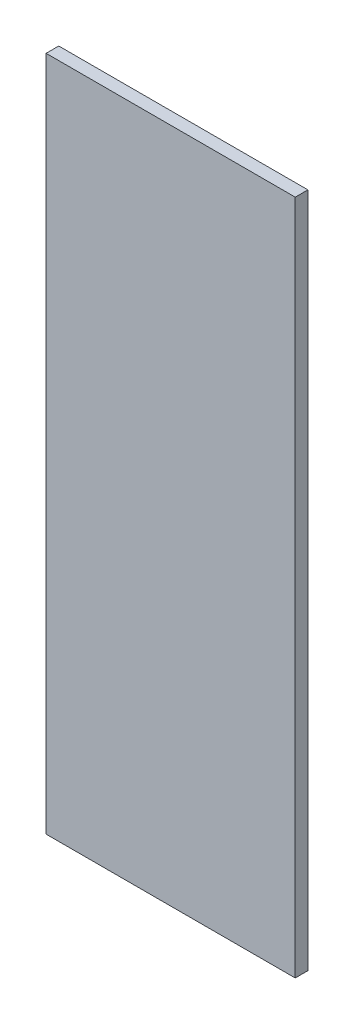
ISO-10303-21;
HEADER;
FILE_DESCRIPTION(('STEP AP214'),'2;1');
FILE_NAME('part.step','',(''),(''),'','','');
FILE_SCHEMA(('AUTOMOTIVE_DESIGN { 1 0 10303 214 1 1 1 1 }'));
ENDSEC;
DATA;
#1=APPLICATION_CONTEXT('core data for automotive mechanical design processes');
#2=APPLICATION_PROTOCOL_DEFINITION('international standard','automotive_design',2000,#1);
#3=PRODUCT_CONTEXT('',#1,'mechanical');
#4=PRODUCT('Part','Part','',(#3));
#5=PRODUCT_RELATED_PRODUCT_CATEGORY('part','',(#4));
#6=PRODUCT_DEFINITION_FORMATION('','',#4);
#7=PRODUCT_DEFINITION_CONTEXT('part definition',#1,'design');
#8=PRODUCT_DEFINITION('design','',#6,#7);
#9=PRODUCT_DEFINITION_SHAPE('','',#8);
#10=(LENGTH_UNIT() NAMED_UNIT(*) SI_UNIT(.MILLI.,.METRE.));
#11=(NAMED_UNIT(*) PLANE_ANGLE_UNIT() SI_UNIT($,.RADIAN.));
#12=(NAMED_UNIT(*) SI_UNIT($,.STERADIAN.) SOLID_ANGLE_UNIT());
#13=UNCERTAINTY_MEASURE_WITH_UNIT(LENGTH_MEASURE(1.E-05),#10,'distance_accuracy_value','');
#14=(GEOMETRIC_REPRESENTATION_CONTEXT(3) GLOBAL_UNCERTAINTY_ASSIGNED_CONTEXT((#13)) GLOBAL_UNIT_ASSIGNED_CONTEXT((#10,
#11,#12)) REPRESENTATION_CONTEXT('',''));
#15=CARTESIAN_POINT('',(0.,0.,0.));
#16=DIRECTION('',(0.,0.,1.));
#17=DIRECTION('',(1.,0.,0.));
#18=AXIS2_PLACEMENT_3D('',#15,#16,#17);
#19=CARTESIAN_POINT('',(87.9420013427734,76.5279998779297,0.));
#20=DIRECTION('',(1.,0.,0.));
#21=DIRECTION('',(0.,-1.,0.));
#22=AXIS2_PLACEMENT_3D('',#19,#20,#21);
#23=PLANE('',#22);
#24=DIRECTION('',(0.,-1.,0.));
#25=VECTOR('',#24,1.);
#26=CARTESIAN_POINT('',(87.9420013427734,76.5279998779297,0.03556));
#27=LINE('',#26,#25);
#28=CARTESIAN_POINT('',(87.9420013427734,76.5279998779297,0.03556));
#29=VERTEX_POINT('',#28);
#30=CARTESIAN_POINT('',(87.9420013427734,74.6279983520508,0.03556));
#31=VERTEX_POINT('',#30);
#32=EDGE_CURVE('E11',#29,#31,#27,.T.);
#33=ORIENTED_EDGE('',*,*,#32,.F.);
#34=DIRECTION('',(0.,0.,1.));
#35=VECTOR('',#34,1.);
#36=CARTESIAN_POINT('',(87.9420013427734,76.5279998779297,0.));
#37=LINE('',#36,#35);
#38=CARTESIAN_POINT('',(87.9420013427734,76.5279998779297,0.));
#39=VERTEX_POINT('',#38);
#40=EDGE_CURVE('E24',#39,#29,#37,.T.);
#41=ORIENTED_EDGE('',*,*,#40,.F.);
#42=DIRECTION('',(0.,-1.,0.));
#43=VECTOR('',#42,1.);
#44=CARTESIAN_POINT('',(87.9420013427734,76.5279998779297,0.));
#45=LINE('',#44,#43);
#46=CARTESIAN_POINT('',(87.9420013427734,74.6279983520508,0.));
#47=VERTEX_POINT('',#46);
#48=EDGE_CURVE('E75',#39,#47,#45,.T.);
#49=ORIENTED_EDGE('',*,*,#48,.T.);
#50=DIRECTION('',(0.,0.,1.));
#51=VECTOR('',#50,1.);
#52=CARTESIAN_POINT('',(87.9420013427734,74.6279983520508,0.));
#53=LINE('',#52,#51);
#54=EDGE_CURVE('E37',#47,#31,#53,.T.);
#55=ORIENTED_EDGE('',*,*,#54,.T.);
#56=EDGE_LOOP('',(#33,#41,#49,#55));
#57=FACE_BOUND('',#56,.T.);
#58=ADVANCED_FACE('F17',(#57),#23,.F.);
#59=CARTESIAN_POINT('',(87.9420013427734,74.6279983520508,0.));
#60=DIRECTION('',(0.,1.,0.));
#61=DIRECTION('',(1.,0.,0.));
#62=AXIS2_PLACEMENT_3D('',#59,#60,#61);
#63=PLANE('',#62);
#64=DIRECTION('',(1.,0.,0.));
#65=VECTOR('',#64,1.);
#66=CARTESIAN_POINT('',(87.9420013427734,74.6279983520508,0.03556));
#67=LINE('',#66,#65);
#68=CARTESIAN_POINT('',(88.6419982910156,74.6279983520508,0.03556));
#69=VERTEX_POINT('',#68);
#70=EDGE_CURVE('E83',#31,#69,#67,.T.);
#71=ORIENTED_EDGE('',*,*,#70,.F.);
#72=ORIENTED_EDGE('',*,*,#54,.F.);
#73=DIRECTION('',(1.,0.,0.));
#74=VECTOR('',#73,1.);
#75=CARTESIAN_POINT('',(87.9420013427734,74.6279983520508,0.));
#76=LINE('',#75,#74);
#77=CARTESIAN_POINT('',(88.6419982910156,74.6279983520508,0.));
#78=VERTEX_POINT('',#77);
#79=EDGE_CURVE('E81',#47,#78,#76,.T.);
#80=ORIENTED_EDGE('',*,*,#79,.T.);
#81=DIRECTION('',(0.,0.,1.));
#82=VECTOR('',#81,1.);
#83=CARTESIAN_POINT('',(88.6419982910156,74.6279983520508,0.));
#84=LINE('',#83,#82);
#85=EDGE_CURVE('E67',#78,#69,#84,.T.);
#86=ORIENTED_EDGE('',*,*,#85,.T.);
#87=EDGE_LOOP('',(#71,#72,#80,#86));
#88=FACE_BOUND('',#87,.T.);
#89=ADVANCED_FACE('F89',(#88),#63,.F.);
#90=CARTESIAN_POINT('',(88.6419982910156,74.6279983520508,0.));
#91=DIRECTION('',(-1.,0.,0.));
#92=DIRECTION('',(0.,1.,0.));
#93=AXIS2_PLACEMENT_3D('',#90,#91,#92);
#94=PLANE('',#93);
#95=DIRECTION('',(0.,1.,0.));
#96=VECTOR('',#95,1.);
#97=CARTESIAN_POINT('',(88.6419982910156,74.6279983520508,0.03556));
#98=LINE('',#97,#96);
#99=CARTESIAN_POINT('',(88.6419982910156,76.5279998779297,0.03556));
#100=VERTEX_POINT('',#99);
#101=EDGE_CURVE('E71',#69,#100,#98,.T.);
#102=ORIENTED_EDGE('',*,*,#101,.F.);
#103=ORIENTED_EDGE('',*,*,#85,.F.);
#104=DIRECTION('',(0.,1.,0.));
#105=VECTOR('',#104,1.);
#106=CARTESIAN_POINT('',(88.6419982910156,74.6279983520508,0.));
#107=LINE('',#106,#105);
#108=CARTESIAN_POINT('',(88.6419982910156,76.5279998779297,0.));
#109=VERTEX_POINT('',#108);
#110=EDGE_CURVE('E63',#78,#109,#107,.T.);
#111=ORIENTED_EDGE('',*,*,#110,.T.);
#112=DIRECTION('',(0.,0.,1.));
#113=VECTOR('',#112,1.);
#114=CARTESIAN_POINT('',(88.6419982910156,76.5279998779297,0.));
#115=LINE('',#114,#113);
#116=EDGE_CURVE('E53',#109,#100,#115,.T.);
#117=ORIENTED_EDGE('',*,*,#116,.T.);
#118=EDGE_LOOP('',(#102,#103,#111,#117));
#119=FACE_BOUND('',#118,.T.);
#120=ADVANCED_FACE('F66',(#119),#94,.F.);
#121=CARTESIAN_POINT('',(88.6419982910156,76.5279998779297,0.));
#122=DIRECTION('',(0.,-1.,0.));
#123=DIRECTION('',(-1.,0.,0.));
#124=AXIS2_PLACEMENT_3D('',#121,#122,#123);
#125=PLANE('',#124);
#126=DIRECTION('',(-1.,0.,0.));
#127=VECTOR('',#126,1.);
#128=CARTESIAN_POINT('',(88.6419982910156,76.5279998779297,0.03556));
#129=LINE('',#128,#127);
#130=EDGE_CURVE('E59',#100,#29,#129,.T.);
#131=ORIENTED_EDGE('',*,*,#130,.F.);
#132=ORIENTED_EDGE('',*,*,#116,.F.);
#133=DIRECTION('',(-1.,0.,0.));
#134=VECTOR('',#133,1.);
#135=CARTESIAN_POINT('',(88.6419982910156,76.5279998779297,0.));
#136=LINE('',#135,#134);
#137=EDGE_CURVE('E57',#109,#39,#136,.T.);
#138=ORIENTED_EDGE('',*,*,#137,.T.);
#139=ORIENTED_EDGE('',*,*,#40,.T.);
#140=EDGE_LOOP('',(#131,#132,#138,#139));
#141=FACE_BOUND('',#140,.T.);
#142=ADVANCED_FACE('F55',(#141),#125,.F.);
#143=CARTESIAN_POINT('',(87.9420013427734,76.5279998779297,0.));
#144=DIRECTION('',(0.,0.,-1.));
#145=DIRECTION('',(-1.,0.,0.));
#146=AXIS2_PLACEMENT_3D('',#143,#144,#145);
#147=PLANE('',#146);
#148=ORIENTED_EDGE('',*,*,#137,.F.);
#149=ORIENTED_EDGE('',*,*,#110,.F.);
#150=ORIENTED_EDGE('',*,*,#79,.F.);
#151=ORIENTED_EDGE('',*,*,#48,.F.);
#152=EDGE_LOOP('',(#148,#149,#150,#151));
#153=FACE_BOUND('',#152,.T.);
#154=ADVANCED_FACE('F74',(#153),#147,.T.);
#155=CARTESIAN_POINT('',(87.9420013427734,76.5279998779297,0.03556));
#156=DIRECTION('',(0.,0.,-1.));
#157=DIRECTION('',(-1.,0.,0.));
#158=AXIS2_PLACEMENT_3D('',#155,#156,#157);
#159=PLANE('',#158);
#160=ORIENTED_EDGE('',*,*,#32,.T.);
#161=ORIENTED_EDGE('',*,*,#70,.T.);
#162=ORIENTED_EDGE('',*,*,#101,.T.);
#163=ORIENTED_EDGE('',*,*,#130,.T.);
#164=EDGE_LOOP('',(#160,#161,#162,#163));
#165=FACE_BOUND('',#164,.T.);
#166=ADVANCED_FACE('F91',(#165),#159,.F.);
#167=CLOSED_SHELL('',(#58,#89,#120,#142,#154,#166));
#168=MANIFOLD_SOLID_BREP('B1',#167);
#169=ADVANCED_BREP_SHAPE_REPRESENTATION('',(#18,#168),#14);
#170=SHAPE_DEFINITION_REPRESENTATION(#9,#169);
ENDSEC;
END-ISO-10303-21;
